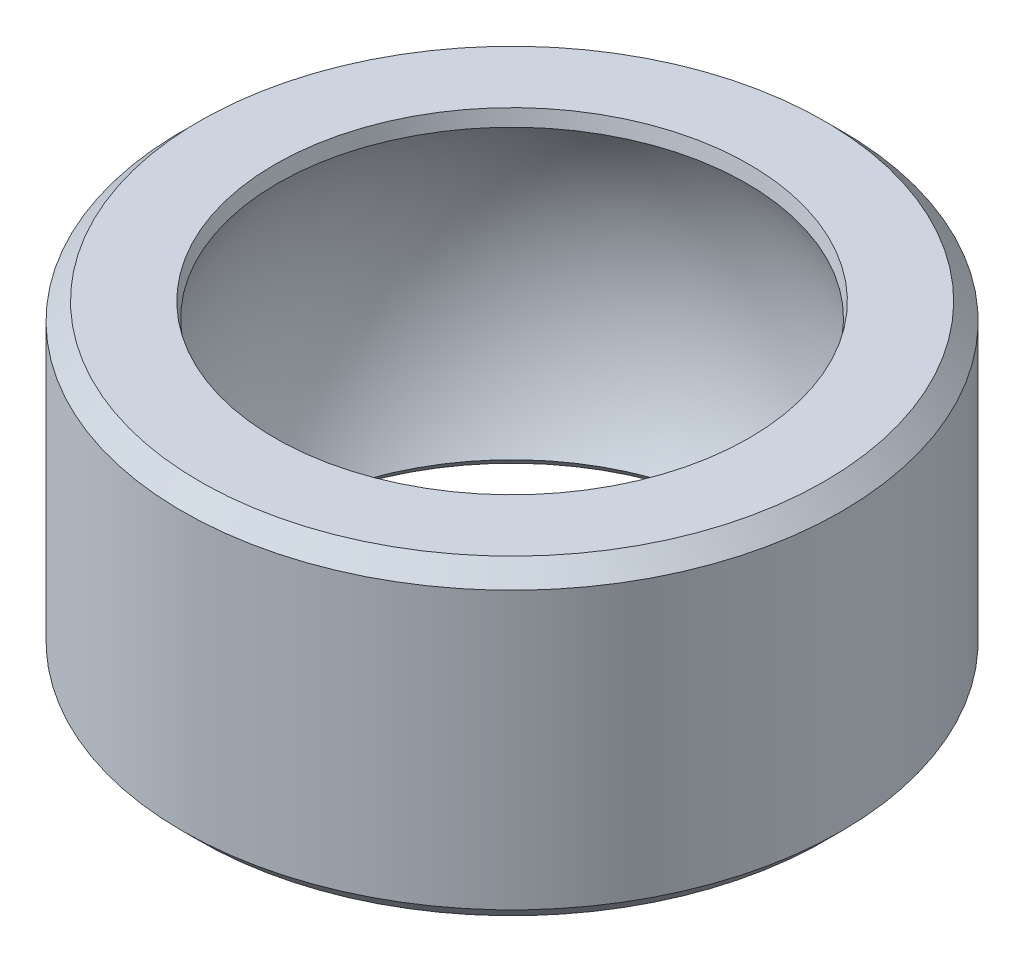
ISO-10303-21;
HEADER;
FILE_DESCRIPTION(('STEP AP214'),'2;1');
FILE_NAME('part.step','',(''),(''),'','','');
FILE_SCHEMA(('AUTOMOTIVE_DESIGN { 1 0 10303 214 1 1 1 1 }'));
ENDSEC;
DATA;
#1=APPLICATION_CONTEXT('core data for automotive mechanical design processes');
#2=APPLICATION_PROTOCOL_DEFINITION('international standard','automotive_design',2000,#1);
#3=PRODUCT_CONTEXT('',#1,'mechanical');
#4=PRODUCT('Part','Part','',(#3));
#5=PRODUCT_RELATED_PRODUCT_CATEGORY('part','',(#4));
#6=PRODUCT_DEFINITION_FORMATION('','',#4);
#7=PRODUCT_DEFINITION_CONTEXT('part definition',#1,'design');
#8=PRODUCT_DEFINITION('design','',#6,#7);
#9=PRODUCT_DEFINITION_SHAPE('','',#8);
#10=(LENGTH_UNIT() NAMED_UNIT(*) SI_UNIT(.MILLI.,.METRE.));
#11=(NAMED_UNIT(*) PLANE_ANGLE_UNIT() SI_UNIT($,.RADIAN.));
#12=(NAMED_UNIT(*) SI_UNIT($,.STERADIAN.) SOLID_ANGLE_UNIT());
#13=UNCERTAINTY_MEASURE_WITH_UNIT(LENGTH_MEASURE(1.E-05),#10,'distance_accuracy_value','');
#14=(GEOMETRIC_REPRESENTATION_CONTEXT(3) GLOBAL_UNCERTAINTY_ASSIGNED_CONTEXT((#13)) GLOBAL_UNIT_ASSIGNED_CONTEXT((#10,
#11,#12)) REPRESENTATION_CONTEXT('',''));
#15=CARTESIAN_POINT('',(0.,0.,0.));
#16=DIRECTION('',(0.,0.,1.));
#17=DIRECTION('',(1.,0.,0.));
#18=AXIS2_PLACEMENT_3D('',#15,#16,#17);
#19=CARTESIAN_POINT('',(0.,0.,0.));
#20=DIRECTION('',(0.,-1.,0.));
#21=DIRECTION('',(-1.,0.,0.));
#22=AXIS2_PLACEMENT_3D('',#19,#20,#21);
#23=SPHERICAL_SURFACE('',#22,7.9);
#24=CARTESIAN_POINT('',(0.,-4.19875001217388,0.));
#25=DIRECTION('',(0.,1.,0.));
#26=DIRECTION('',(-1.,0.,0.));
#27=AXIS2_PLACEMENT_3D('',#24,#25,#26);
#28=CIRCLE('',#27,6.69182324447305);
#29=CARTESIAN_POINT('',(-6.69182324447305,-4.19875001217388,0.));
#30=VERTEX_POINT('',#29);
#31=EDGE_CURVE('E65',#30,#30,#28,.F.);
#32=CARTESIAN_POINT('',(0.,4.06548655087634,0.));
#33=DIRECTION('',(0.,-1.,0.));
#34=DIRECTION('',(1.,0.,0.));
#35=AXIS2_PLACEMENT_3D('',#32,#33,#34);
#36=CIRCLE('',#35,6.77361196885706);
#37=CARTESIAN_POINT('',(-6.77361196885706,4.06548655087634,0.));
#38=VERTEX_POINT('',#37);
#39=EDGE_CURVE('E68',#38,#38,#36,.F.);
#40=CARTESIAN_POINT('',(-6.69182324447305,-4.19875001217388,0.));
#41=CARTESIAN_POINT('',(-6.73997465286023,-4.12200920051235,0.));
#42=CARTESIAN_POINT('',(-6.78680484935782,-4.04443944784901,0.));
#43=CARTESIAN_POINT('',(-6.87776991096806,-3.88773532452362,0.));
#44=CARTESIAN_POINT('',(-6.92190477608072,-3.80860095386157,0.));
#45=CARTESIAN_POINT('',(-7.00742626731535,-3.64886085854367,0.));
#46=CARTESIAN_POINT('',(-7.04881289343732,-3.56825513388782,0.));
#47=CARTESIAN_POINT('',(-7.12878910635429,-3.40566783209804,0.));
#48=CARTESIAN_POINT('',(-7.16737869314928,-3.32368625496411,0.));
#49=CARTESIAN_POINT('',(-7.24171510833893,-3.15844424510407,0.));
#50=CARTESIAN_POINT('',(-7.27746193673357,-3.07518381237796,0.));
#51=CARTESIAN_POINT('',(-7.34607054181351,-2.90748263736489,0.));
#52=CARTESIAN_POINT('',(-7.3789323184988,-2.82304189507794,0.));
#53=CARTESIAN_POINT('',(-7.44173192485881,-2.65308003432259,0.));
#54=CARTESIAN_POINT('',(-7.47166975453353,-2.56755891585419,0.));
#55=CARTESIAN_POINT('',(-7.52858603646078,-2.39553751729533,0.));
#56=CARTESIAN_POINT('',(-7.55556448871331,-2.30903723720488,0.));
#57=CARTESIAN_POINT('',(-7.60653008661936,-2.1351598881112,0.));
#58=CARTESIAN_POINT('',(-7.63051723227288,-2.04778281910798,0.));
#59=CARTESIAN_POINT('',(-7.67547182832393,-1.87225530275905,0.));
#60=CARTESIAN_POINT('',(-7.69643927872147,-1.78410485541334,0.));
#61=CARTESIAN_POINT('',(-7.73532966932022,-1.60713490819177,0.));
#62=CARTESIAN_POINT('',(-7.75325260952143,-1.5183154083159,0.));
#63=CARTESIAN_POINT('',(-7.7860327679797,-1.34011247368142,0.));
#64=CARTESIAN_POINT('',(-7.80088998623677,-1.2507290389228,0.));
#65=CARTESIAN_POINT('',(-7.82752111732673,-1.07150401958216,0.));
#66=CARTESIAN_POINT('',(-7.83929503015961,-0.981662435000132,0.));
#67=CARTESIAN_POINT('',(-7.85974561600666,-0.801627443292053,0.));
#68=CARTESIAN_POINT('',(-7.86842228902082,-0.711434036166002,0.));
#69=CARTESIAN_POINT('',(-7.88266812641063,-0.530802143030073,0.));
#70=CARTESIAN_POINT('',(-7.88823729078627,-0.440363657020194,0.));
#71=CARTESIAN_POINT('',(-7.89626151980765,-0.259348639827085,0.));
#72=CARTESIAN_POINT('',(-7.8987165844534,-0.168772108643855,0.));
#73=CARTESIAN_POINT('',(-7.90050970845243,0.0124118018093978,0.));
#74=CARTESIAN_POINT('',(-7.89984776780571,0.10301918107942,0.));
#75=CARTESIAN_POINT('',(-7.89540766462485,0.284157554111068,0.));
#76=CARTESIAN_POINT('',(-7.8916295020907,0.374688547872694,0.));
#77=CARTESIAN_POINT('',(-7.88096142658037,0.555567006694391,0.));
#78=CARTESIAN_POINT('',(-7.87407151360419,0.645914471754463,0.));
#79=CARTESIAN_POINT('',(-7.85718809140379,0.826318947185696,0.));
#80=CARTESIAN_POINT('',(-7.84719458217956,0.916375957556858,0.));
#81=CARTESIAN_POINT('',(-7.82411579477462,1.09609294137503,0.));
#82=CARTESIAN_POINT('',(-7.8110305165939,1.18575291482204,0.));
#83=CARTESIAN_POINT('',(-7.7817836776696,1.36456971244975,0.));
#84=CARTESIAN_POINT('',(-7.76562211692602,1.45372653663044,0.));
#85=CARTESIAN_POINT('',(-7.7302418400358,1.63143151885576,0.));
#86=CARTESIAN_POINT('',(-7.71102312388916,1.71997967690039,0.));
#87=CARTESIAN_POINT('',(-7.66955128151098,1.89636253035133,0.));
#88=CARTESIAN_POINT('',(-7.64729815527943,1.98419722575764,0.));
#89=CARTESIAN_POINT('',(-7.59978382918023,2.15904920176336,0.));
#90=CARTESIAN_POINT('',(-7.57452262931258,2.24606648236277,0.));
#91=CARTESIAN_POINT('',(-7.5210220527571,2.41918064417167,0.));
#92=CARTESIAN_POINT('',(-7.49278267606929,2.50527752538116,0.));
#93=CARTESIAN_POINT('',(-7.43335916615995,2.6764489924557,0.));
#94=CARTESIAN_POINT('',(-7.40217503293844,2.76152357832074,0.));
#95=CARTESIAN_POINT('',(-7.33689891981553,2.9305497711056,0.));
#96=CARTESIAN_POINT('',(-7.30280693991414,3.01450137802541,0.));
#97=CARTESIAN_POINT('',(-7.23175546808521,3.18118224914377,0.));
#98=CARTESIAN_POINT('',(-7.19479597615766,3.26391151334232,0.));
#99=CARTESIAN_POINT('',(-7.11805327068335,3.42804981628317,0.));
#100=CARTESIAN_POINT('',(-7.07827005713659,3.50945885502549,0.));
#101=CARTESIAN_POINT('',(-6.99592680908577,3.67086025841346,0.));
#102=CARTESIAN_POINT('',(-6.95336677458172,3.75085262305913,0.));
#103=CARTESIAN_POINT('',(-6.86552093602683,3.90932638539701,0.));
#104=CARTESIAN_POINT('',(-6.82023513197601,3.98780778308923,0.));
#105=CARTESIAN_POINT('',(-6.77361196885706,4.06548655087634,0.));
#106=B_SPLINE_CURVE_WITH_KNOTS('',3,(#40,#41,#42,#43,#44,#45,#46,#47,#48,#49,#50,#51,#52,#53,
#54,#55,#56,#57,#58,#59,#60,#61,#62,#63,#64,#65,#66,#67,#68,#69,#70,#71,#72,#73,#74,#75,#76,#77,
#78,#79,#80,#81,#82,#83,#84,#85,#86,#87,#88,#89,#90,#91,#92,#93,#94,#95,#96,#97,#98,#99,#100,
#101,#102,#103,#104,#105),.UNSPECIFIED.,.F.,.F.,(4,2,2,2,2,2,2,2,2,2,2,2,2,2,2,2,2,2,2,2,2,2,2,
2,2,2,2,2,2,2,2,2,4),(0.,0.271775773288451,0.543551546576901,0.815327319865352,1.0871030931538,
1.35887886644225,1.6306546397307,1.90243041301915,2.17420618630761,2.44598195959606,
2.71775773288451,2.98953350617296,3.26130927946141,3.53308505274986,3.80486082603831,
4.07663659932676,4.34841237261521,4.62018814590366,4.89196391919211,5.16373969248056,
5.43551546576902,5.70729123905747,5.97906701234592,6.25084278563437,6.52261855892282,
6.79439433221127,7.06617010549972,7.33794587878817,7.60972165207662,7.88149742536507,
8.15327319865352,8.42504897194197,8.69682474523042),.UNSPECIFIED.);
#107=EDGE_CURVE('BSEAM38',#30,#38,#106,.T.);
#108=ORIENTED_EDGE('',*,*,#31,.T.);
#109=ORIENTED_EDGE('',*,*,#39,.T.);
#110=ORIENTED_EDGE('',*,*,#107,.T.);
#111=ORIENTED_EDGE('',*,*,#107,.F.);
#112=EDGE_LOOP('',(#108,#110,#109,#111));
#113=FACE_BOUND('',#112,.T.);
#114=ADVANCED_FACE('F38',(#113),#23,.F.);
#115=CARTESIAN_POINT('',(-6.49307323229917,-4.5,0.));
#116=DIRECTION('',(0.,1.,0.));
#117=DIRECTION('',(-1.,0.,0.));
#118=AXIS2_PLACEMENT_3D('',#115,#116,#117);
#119=PLANE('',#118);
#120=CARTESIAN_POINT('',(0.,-4.5,0.));
#121=DIRECTION('',(0.,1.,0.));
#122=DIRECTION('',(-1.,0.,0.));
#123=AXIS2_PLACEMENT_3D('',#120,#121,#122);
#124=CIRCLE('',#123,6.99307323229917);
#125=CARTESIAN_POINT('',(-6.99307323229917,-4.5,0.));
#126=VERTEX_POINT('',#125);
#127=EDGE_CURVE('E59',#126,#126,#124,.T.);
#128=ORIENTED_EDGE('',*,*,#127,.T.);
#129=EDGE_LOOP('',(#128));
#130=FACE_BOUND('',#129,.T.);
#131=CARTESIAN_POINT('',(0.,-4.5,0.));
#132=DIRECTION('',(0.,1.,0.));
#133=DIRECTION('',(-1.,0.,0.));
#134=AXIS2_PLACEMENT_3D('',#131,#132,#133);
#135=CIRCLE('',#134,9.025);
#136=CARTESIAN_POINT('',(-9.025,-4.5,0.));
#137=VERTEX_POINT('',#136);
#138=EDGE_CURVE('E62',#137,#137,#135,.F.);
#139=ORIENTED_EDGE('',*,*,#138,.T.);
#140=EDGE_LOOP('',(#139));
#141=FACE_BOUND('',#140,.T.);
#142=ADVANCED_FACE('F82',(#130,#141),#119,.F.);
#143=CARTESIAN_POINT('',(0.,-4.5,0.));
#144=DIRECTION('',(0.,-1.,0.));
#145=DIRECTION('',(1.,0.,0.));
#146=AXIS2_PLACEMENT_3D('',#143,#144,#145);
#147=CYLINDRICAL_SURFACE('',#146,9.525);
#148=CARTESIAN_POINT('',(0.,-4.,0.));
#149=DIRECTION('',(0.,1.,0.));
#150=DIRECTION('',(-1.,0.,0.));
#151=AXIS2_PLACEMENT_3D('',#148,#149,#150);
#152=CIRCLE('',#151,9.525);
#153=CARTESIAN_POINT('',(-9.525,-4.,0.));
#154=VERTEX_POINT('',#153);
#155=EDGE_CURVE('E50',#154,#154,#152,.T.);
#156=ORIENTED_EDGE('',*,*,#155,.T.);
#157=EDGE_LOOP('',(#156));
#158=FACE_BOUND('',#157,.T.);
#159=CARTESIAN_POINT('',(0.,4.,0.));
#160=DIRECTION('',(0.,-1.,0.));
#161=DIRECTION('',(1.,0.,0.));
#162=AXIS2_PLACEMENT_3D('',#159,#160,#161);
#163=CIRCLE('',#162,9.525);
#164=CARTESIAN_POINT('',(9.525,4.,0.));
#165=VERTEX_POINT('',#164);
#166=EDGE_CURVE('E54',#165,#165,#163,.T.);
#167=ORIENTED_EDGE('',*,*,#166,.T.);
#168=EDGE_LOOP('',(#167));
#169=FACE_BOUND('',#168,.T.);
#170=ADVANCED_FACE('F88',(#158,#169),#147,.T.);
#171=CARTESIAN_POINT('',(-6.49307323229917,4.5,0.));
#172=DIRECTION('',(0.,-1.,0.));
#173=DIRECTION('',(1.,0.,0.));
#174=AXIS2_PLACEMENT_3D('',#171,#172,#173);
#175=PLANE('',#174);
#176=CARTESIAN_POINT('',(0.,4.5,0.));
#177=DIRECTION('',(0.,-1.,0.));
#178=DIRECTION('',(1.,0.,0.));
#179=AXIS2_PLACEMENT_3D('',#176,#177,#178);
#180=CIRCLE('',#179,9.025);
#181=CARTESIAN_POINT('',(9.02499999999999,4.5,0.));
#182=VERTEX_POINT('',#181);
#183=EDGE_CURVE('E10',#182,#182,#180,.F.);
#184=ORIENTED_EDGE('',*,*,#183,.T.);
#185=EDGE_LOOP('',(#184));
#186=FACE_BOUND('',#185,.T.);
#187=CARTESIAN_POINT('',(0.,4.5,0.));
#188=DIRECTION('',(0.,-1.,0.));
#189=DIRECTION('',(1.,0.,0.));
#190=AXIS2_PLACEMENT_3D('',#187,#188,#189);
#191=CIRCLE('',#190,6.85239040562558);
#192=CARTESIAN_POINT('',(6.85239040562558,4.5,0.));
#193=VERTEX_POINT('',#192);
#194=EDGE_CURVE('E46',#193,#193,#191,.T.);
#195=ORIENTED_EDGE('',*,*,#194,.T.);
#196=EDGE_LOOP('',(#195));
#197=FACE_BOUND('',#196,.T.);
#198=ADVANCED_FACE('F100',(#186,#197),#175,.F.);
#199=CARTESIAN_POINT('',(0.,-4.19875001217388,0.));
#200=DIRECTION('',(0.,-1.,0.));
#201=DIRECTION('',(1.,0.,0.));
#202=AXIS2_PLACEMENT_3D('',#199,#200,#201);
#203=CONICAL_SURFACE('',#202,6.69182324447305,0.78539816339745);
#204=ORIENTED_EDGE('',*,*,#127,.F.);
#205=EDGE_LOOP('',(#204));
#206=FACE_BOUND('',#205,.T.);
#207=ORIENTED_EDGE('',*,*,#31,.F.);
#208=EDGE_LOOP('',(#207));
#209=FACE_BOUND('',#208,.T.);
#210=ADVANCED_FACE('F94',(#206,#209),#203,.F.);
#211=CARTESIAN_POINT('',(0.,-4.5,0.));
#212=DIRECTION('',(0.,1.,0.));
#213=DIRECTION('',(-1.,0.,0.));
#214=AXIS2_PLACEMENT_3D('',#211,#212,#213);
#215=CONICAL_SURFACE('',#214,9.025,0.785398163397448);
#216=ORIENTED_EDGE('',*,*,#155,.F.);
#217=EDGE_LOOP('',(#216));
#218=FACE_BOUND('',#217,.T.);
#219=ORIENTED_EDGE('',*,*,#138,.F.);
#220=EDGE_LOOP('',(#219));
#221=FACE_BOUND('',#220,.T.);
#222=ADVANCED_FACE('F79',(#218,#221),#215,.T.);
#223=CARTESIAN_POINT('',(0.,4.,0.));
#224=DIRECTION('',(0.,-1.,0.));
#225=DIRECTION('',(1.,0.,0.));
#226=AXIS2_PLACEMENT_3D('',#223,#224,#225);
#227=CONICAL_SURFACE('',#226,9.525,0.785398163397448);
#228=ORIENTED_EDGE('',*,*,#183,.F.);
#229=EDGE_LOOP('',(#228));
#230=FACE_BOUND('',#229,.T.);
#231=ORIENTED_EDGE('',*,*,#166,.F.);
#232=EDGE_LOOP('',(#231));
#233=FACE_BOUND('',#232,.T.);
#234=ADVANCED_FACE('F75',(#230,#233),#227,.T.);
#235=CARTESIAN_POINT('',(0.,4.5,0.));
#236=DIRECTION('',(0.,1.,0.));
#237=DIRECTION('',(-1.,0.,0.));
#238=AXIS2_PLACEMENT_3D('',#235,#236,#237);
#239=CONICAL_SURFACE('',#238,6.85239040562558,0.179354413025382);
#240=ORIENTED_EDGE('',*,*,#39,.F.);
#241=EDGE_LOOP('',(#240));
#242=FACE_BOUND('',#241,.T.);
#243=ORIENTED_EDGE('',*,*,#194,.F.);
#244=EDGE_LOOP('',(#243));
#245=FACE_BOUND('',#244,.T.);
#246=ADVANCED_FACE('F41',(#242,#245),#239,.F.);
#247=CLOSED_SHELL('',(#114,#142,#170,#198,#210,#222,#234,#246));
#248=MANIFOLD_SOLID_BREP('B2',#247);
#249=ADVANCED_BREP_SHAPE_REPRESENTATION('',(#18,#248),#14);
#250=SHAPE_DEFINITION_REPRESENTATION(#9,#249);
ENDSEC;
END-ISO-10303-21;
